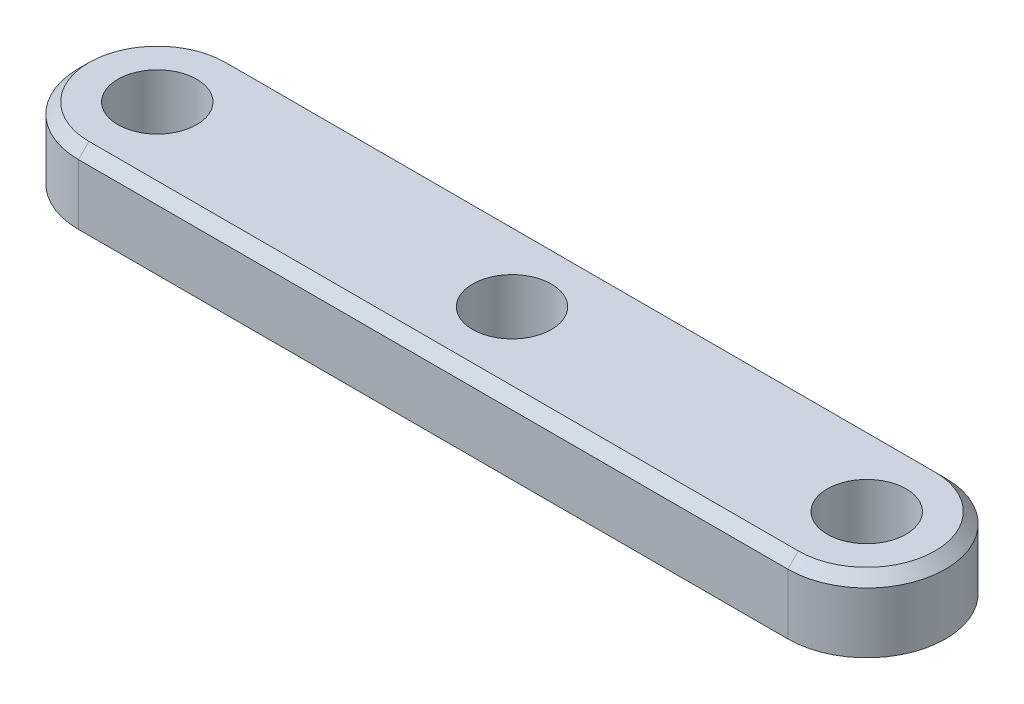
ISO-10303-21;
HEADER;
FILE_DESCRIPTION(('STEP AP214'),'2;1');
FILE_NAME('part.step','',(''),(''),'','','');
FILE_SCHEMA(('AUTOMOTIVE_DESIGN { 1 0 10303 214 1 1 1 1 }'));
ENDSEC;
DATA;
#1=APPLICATION_CONTEXT('core data for automotive mechanical design processes');
#2=APPLICATION_PROTOCOL_DEFINITION('international standard','automotive_design',2000,#1);
#3=PRODUCT_CONTEXT('',#1,'mechanical');
#4=PRODUCT('Part','Part','',(#3));
#5=PRODUCT_RELATED_PRODUCT_CATEGORY('part','',(#4));
#6=PRODUCT_DEFINITION_FORMATION('','',#4);
#7=PRODUCT_DEFINITION_CONTEXT('part definition',#1,'design');
#8=PRODUCT_DEFINITION('design','',#6,#7);
#9=PRODUCT_DEFINITION_SHAPE('','',#8);
#10=(LENGTH_UNIT() NAMED_UNIT(*) SI_UNIT(.MILLI.,.METRE.));
#11=(NAMED_UNIT(*) PLANE_ANGLE_UNIT() SI_UNIT($,.RADIAN.));
#12=(NAMED_UNIT(*) SI_UNIT($,.STERADIAN.) SOLID_ANGLE_UNIT());
#13=UNCERTAINTY_MEASURE_WITH_UNIT(LENGTH_MEASURE(1.E-05),#10,'distance_accuracy_value','');
#14=(GEOMETRIC_REPRESENTATION_CONTEXT(3) GLOBAL_UNCERTAINTY_ASSIGNED_CONTEXT((#13)) GLOBAL_UNIT_ASSIGNED_CONTEXT((#10,
#11,#12)) REPRESENTATION_CONTEXT('',''));
#15=CARTESIAN_POINT('',(0.,0.,0.));
#16=DIRECTION('',(0.,0.,1.));
#17=DIRECTION('',(1.,0.,0.));
#18=AXIS2_PLACEMENT_3D('',#15,#16,#17);
#19=CARTESIAN_POINT('',(-13.5,1.35,0.));
#20=DIRECTION('',(0.,1.,0.));
#21=DIRECTION('',(0.,0.,1.));
#22=AXIS2_PLACEMENT_3D('',#19,#20,#21);
#23=PLANE('',#22);
#24=DIRECTION('',(1.,0.,0.));
#25=VECTOR('',#24,1.);
#26=CARTESIAN_POINT('',(13.5,1.35,2.6));
#27=LINE('',#26,#25);
#28=CARTESIAN_POINT('',(-13.5,1.35,2.60000000000001));
#29=VERTEX_POINT('',#28);
#30=CARTESIAN_POINT('',(13.5,1.35,2.6));
#31=VERTEX_POINT('',#30);
#32=EDGE_CURVE('E105',#29,#31,#27,.T.);
#33=ORIENTED_EDGE('',*,*,#32,.T.);
#34=CARTESIAN_POINT('',(13.5,1.35,0.));
#35=DIRECTION('',(0.,1.,0.));
#36=DIRECTION('',(0.,0.,1.));
#37=AXIS2_PLACEMENT_3D('',#34,#35,#36);
#38=CIRCLE('',#37,2.60000000000001);
#39=CARTESIAN_POINT('',(13.5,1.35,-2.60000000000001));
#40=VERTEX_POINT('',#39);
#41=EDGE_CURVE('E150',#31,#40,#38,.T.);
#42=ORIENTED_EDGE('',*,*,#41,.T.);
#43=DIRECTION('',(-1.,0.,0.));
#44=VECTOR('',#43,1.);
#45=CARTESIAN_POINT('',(-13.5,1.35,-2.60000000000001));
#46=LINE('',#45,#44);
#47=CARTESIAN_POINT('',(-13.5,1.35,-2.6));
#48=VERTEX_POINT('',#47);
#49=EDGE_CURVE('E147',#40,#48,#46,.T.);
#50=ORIENTED_EDGE('',*,*,#49,.T.);
#51=CARTESIAN_POINT('',(-13.5,1.35,0.));
#52=DIRECTION('',(0.,1.,0.));
#53=DIRECTION('',(0.,0.,1.));
#54=AXIS2_PLACEMENT_3D('',#51,#52,#53);
#55=CIRCLE('',#54,2.60000000000001);
#56=EDGE_CURVE('E144',#48,#29,#55,.T.);
#57=ORIENTED_EDGE('',*,*,#56,.T.);
#58=EDGE_LOOP('',(#33,#42,#50,#57));
#59=FACE_BOUND('',#58,.T.);
#60=CARTESIAN_POINT('',(13.5,1.35,0.));
#61=DIRECTION('',(0.,1.,0.));
#62=DIRECTION('',(0.,0.,-1.));
#63=AXIS2_PLACEMENT_3D('',#60,#61,#62);
#64=CIRCLE('',#63,1.5);
#65=CARTESIAN_POINT('',(13.5,1.35,-1.5));
#66=VERTEX_POINT('',#65);
#67=EDGE_CURVE('E192',#66,#66,#64,.T.);
#68=ORIENTED_EDGE('',*,*,#67,.F.);
#69=EDGE_LOOP('',(#68));
#70=FACE_BOUND('',#69,.T.);
#71=CARTESIAN_POINT('',(-13.5,1.35,0.));
#72=DIRECTION('',(0.,1.,0.));
#73=DIRECTION('',(0.,0.,1.));
#74=AXIS2_PLACEMENT_3D('',#71,#72,#73);
#75=CIRCLE('',#74,1.5);
#76=CARTESIAN_POINT('',(-13.5,1.35,1.5));
#77=VERTEX_POINT('',#76);
#78=EDGE_CURVE('E122',#77,#77,#75,.T.);
#79=ORIENTED_EDGE('',*,*,#78,.F.);
#80=EDGE_LOOP('',(#79));
#81=FACE_BOUND('',#80,.T.);
#82=CARTESIAN_POINT('',(0.,1.35,0.));
#83=DIRECTION('',(0.,1.,0.));
#84=DIRECTION('',(0.,0.,1.));
#85=AXIS2_PLACEMENT_3D('',#82,#83,#84);
#86=CIRCLE('',#85,1.5);
#87=CARTESIAN_POINT('',(0.,1.35,1.5));
#88=VERTEX_POINT('',#87);
#89=EDGE_CURVE('E183',#88,#88,#86,.T.);
#90=ORIENTED_EDGE('',*,*,#89,.F.);
#91=EDGE_LOOP('',(#90));
#92=FACE_BOUND('',#91,.T.);
#93=ADVANCED_FACE('F45',(#59,#70,#81,#92),#23,.T.);
#94=CARTESIAN_POINT('',(-13.5,-1.35,0.));
#95=DIRECTION('',(0.,1.,0.));
#96=DIRECTION('',(0.,0.,1.));
#97=AXIS2_PLACEMENT_3D('',#94,#95,#96);
#98=PLANE('',#97);
#99=CARTESIAN_POINT('',(-13.5,-1.35,0.));
#100=DIRECTION('',(0.,1.,0.));
#101=DIRECTION('',(0.,0.,1.));
#102=AXIS2_PLACEMENT_3D('',#99,#100,#101);
#103=CIRCLE('',#102,3.);
#104=CARTESIAN_POINT('',(-13.5,-1.35,-3.));
#105=VERTEX_POINT('',#104);
#106=CARTESIAN_POINT('',(-13.5,-1.35,3.));
#107=VERTEX_POINT('',#106);
#108=EDGE_CURVE('E113',#105,#107,#103,.T.);
#109=ORIENTED_EDGE('',*,*,#108,.F.);
#110=DIRECTION('',(-1.,0.,0.));
#111=VECTOR('',#110,1.);
#112=CARTESIAN_POINT('',(-13.5,-1.35,-3.));
#113=LINE('',#112,#111);
#114=CARTESIAN_POINT('',(13.5,-1.35,-3.00000000000001));
#115=VERTEX_POINT('',#114);
#116=EDGE_CURVE('E132',#115,#105,#113,.T.);
#117=ORIENTED_EDGE('',*,*,#116,.F.);
#118=CARTESIAN_POINT('',(13.5,-1.35,0.));
#119=DIRECTION('',(0.,1.,0.));
#120=DIRECTION('',(0.,0.,1.));
#121=AXIS2_PLACEMENT_3D('',#118,#119,#120);
#122=CIRCLE('',#121,3.);
#123=CARTESIAN_POINT('',(13.5,-1.35,3.));
#124=VERTEX_POINT('',#123);
#125=EDGE_CURVE('E115',#124,#115,#122,.T.);
#126=ORIENTED_EDGE('',*,*,#125,.F.);
#127=DIRECTION('',(1.,0.,0.));
#128=VECTOR('',#127,1.);
#129=CARTESIAN_POINT('',(-13.5,-1.35,3.));
#130=LINE('',#129,#128);
#131=EDGE_CURVE('E101',#107,#124,#130,.T.);
#132=ORIENTED_EDGE('',*,*,#131,.F.);
#133=EDGE_LOOP('',(#109,#117,#126,#132));
#134=FACE_BOUND('',#133,.T.);
#135=CARTESIAN_POINT('',(-13.5,-1.35,0.));
#136=DIRECTION('',(0.,1.,0.));
#137=DIRECTION('',(0.,0.,1.));
#138=AXIS2_PLACEMENT_3D('',#135,#136,#137);
#139=CIRCLE('',#138,1.5);
#140=CARTESIAN_POINT('',(-13.5,-1.35,1.5));
#141=VERTEX_POINT('',#140);
#142=EDGE_CURVE('E126',#141,#141,#139,.T.);
#143=ORIENTED_EDGE('',*,*,#142,.T.);
#144=EDGE_LOOP('',(#143));
#145=FACE_BOUND('',#144,.T.);
#146=CARTESIAN_POINT('',(13.5,-1.35,0.));
#147=DIRECTION('',(0.,1.,0.));
#148=DIRECTION('',(0.,0.,-1.));
#149=AXIS2_PLACEMENT_3D('',#146,#147,#148);
#150=CIRCLE('',#149,1.5);
#151=CARTESIAN_POINT('',(13.5,-1.35,-1.5));
#152=VERTEX_POINT('',#151);
#153=EDGE_CURVE('E189',#152,#152,#150,.T.);
#154=ORIENTED_EDGE('',*,*,#153,.T.);
#155=EDGE_LOOP('',(#154));
#156=FACE_BOUND('',#155,.T.);
#157=CARTESIAN_POINT('',(0.,-1.35,0.));
#158=DIRECTION('',(0.,1.,0.));
#159=DIRECTION('',(0.,0.,1.));
#160=AXIS2_PLACEMENT_3D('',#157,#158,#159);
#161=CIRCLE('',#160,1.5);
#162=CARTESIAN_POINT('',(0.,-1.35,1.5));
#163=VERTEX_POINT('',#162);
#164=EDGE_CURVE('E177',#163,#163,#161,.T.);
#165=ORIENTED_EDGE('',*,*,#164,.T.);
#166=EDGE_LOOP('',(#165));
#167=FACE_BOUND('',#166,.T.);
#168=ADVANCED_FACE('F110',(#134,#145,#156,#167),#98,.F.);
#169=CARTESIAN_POINT('',(-13.5,1.35,0.));
#170=DIRECTION('',(0.,-1.,0.));
#171=DIRECTION('',(0.,0.,-1.));
#172=AXIS2_PLACEMENT_3D('',#169,#170,#171);
#173=CYLINDRICAL_SURFACE('',#172,3.);
#174=DIRECTION('',(0.,-1.,0.));
#175=VECTOR('',#174,1.);
#176=CARTESIAN_POINT('',(-13.5,1.35,3.));
#177=LINE('',#176,#175);
#178=CARTESIAN_POINT('',(-13.5,0.949999999999999,3.));
#179=VERTEX_POINT('',#178);
#180=EDGE_CURVE('E98',#179,#107,#177,.T.);
#181=ORIENTED_EDGE('',*,*,#180,.F.);
#182=CARTESIAN_POINT('',(-13.5,0.949999999999999,0.));
#183=DIRECTION('',(0.,1.,0.));
#184=DIRECTION('',(0.,0.,1.));
#185=AXIS2_PLACEMENT_3D('',#182,#183,#184);
#186=CIRCLE('',#185,3.);
#187=CARTESIAN_POINT('',(-13.5,0.949999999999999,-3.));
#188=VERTEX_POINT('',#187);
#189=EDGE_CURVE('E56',#179,#188,#186,.F.);
#190=ORIENTED_EDGE('',*,*,#189,.T.);
#191=DIRECTION('',(0.,-1.,0.));
#192=VECTOR('',#191,1.);
#193=CARTESIAN_POINT('',(-13.5,1.35,-3.));
#194=LINE('',#193,#192);
#195=EDGE_CURVE('E119',#188,#105,#194,.T.);
#196=ORIENTED_EDGE('',*,*,#195,.T.);
#197=ORIENTED_EDGE('',*,*,#108,.T.);
#198=EDGE_LOOP('',(#181,#190,#196,#197));
#199=FACE_BOUND('',#198,.T.);
#200=ADVANCED_FACE('F118',(#199),#173,.T.);
#201=CARTESIAN_POINT('',(-13.5,1.35,3.));
#202=DIRECTION('',(0.,0.,-1.));
#203=DIRECTION('',(-1.,0.,0.));
#204=AXIS2_PLACEMENT_3D('',#201,#202,#203);
#205=PLANE('',#204);
#206=DIRECTION('',(0.,-1.,0.));
#207=VECTOR('',#206,1.);
#208=CARTESIAN_POINT('',(13.5,1.35,3.));
#209=LINE('',#208,#207);
#210=CARTESIAN_POINT('',(13.5,0.949999999999999,3.));
#211=VERTEX_POINT('',#210);
#212=EDGE_CURVE('E106',#211,#124,#209,.T.);
#213=ORIENTED_EDGE('',*,*,#212,.F.);
#214=DIRECTION('',(-1.,0.,0.));
#215=VECTOR('',#214,1.);
#216=CARTESIAN_POINT('',(-13.5,0.949999999999999,3.));
#217=LINE('',#216,#215);
#218=EDGE_CURVE('E11',#211,#179,#217,.T.);
#219=ORIENTED_EDGE('',*,*,#218,.T.);
#220=ORIENTED_EDGE('',*,*,#180,.T.);
#221=ORIENTED_EDGE('',*,*,#131,.T.);
#222=EDGE_LOOP('',(#213,#219,#220,#221));
#223=FACE_BOUND('',#222,.T.);
#224=ADVANCED_FACE('F100',(#223),#205,.F.);
#225=CARTESIAN_POINT('',(13.5,1.35,0.));
#226=DIRECTION('',(0.,-1.,0.));
#227=DIRECTION('',(0.,0.,-1.));
#228=AXIS2_PLACEMENT_3D('',#225,#226,#227);
#229=CYLINDRICAL_SURFACE('',#228,3.);
#230=DIRECTION('',(0.,-1.,0.));
#231=VECTOR('',#230,1.);
#232=CARTESIAN_POINT('',(13.5,1.35,-3.00000000000001));
#233=LINE('',#232,#231);
#234=CARTESIAN_POINT('',(13.5,0.949999999999999,-3.00000000000001));
#235=VERTEX_POINT('',#234);
#236=EDGE_CURVE('E137',#235,#115,#233,.T.);
#237=ORIENTED_EDGE('',*,*,#236,.F.);
#238=CARTESIAN_POINT('',(13.5,0.949999999999999,0.));
#239=DIRECTION('',(0.,1.,0.));
#240=DIRECTION('',(0.,0.,1.));
#241=AXIS2_PLACEMENT_3D('',#238,#239,#240);
#242=CIRCLE('',#241,3.);
#243=EDGE_CURVE('E154',#235,#211,#242,.F.);
#244=ORIENTED_EDGE('',*,*,#243,.T.);
#245=ORIENTED_EDGE('',*,*,#212,.T.);
#246=ORIENTED_EDGE('',*,*,#125,.T.);
#247=EDGE_LOOP('',(#237,#244,#245,#246));
#248=FACE_BOUND('',#247,.T.);
#249=ADVANCED_FACE('F227',(#248),#229,.T.);
#250=CARTESIAN_POINT('',(-13.5,1.35,-3.));
#251=DIRECTION('',(0.,0.,1.));
#252=DIRECTION('',(1.,0.,0.));
#253=AXIS2_PLACEMENT_3D('',#250,#251,#252);
#254=PLANE('',#253);
#255=ORIENTED_EDGE('',*,*,#195,.F.);
#256=DIRECTION('',(1.,0.,0.));
#257=VECTOR('',#256,1.);
#258=CARTESIAN_POINT('',(13.5,0.949999999999999,-3.00000000000001));
#259=LINE('',#258,#257);
#260=EDGE_CURVE('E158',#188,#235,#259,.T.);
#261=ORIENTED_EDGE('',*,*,#260,.T.);
#262=ORIENTED_EDGE('',*,*,#236,.T.);
#263=ORIENTED_EDGE('',*,*,#116,.T.);
#264=EDGE_LOOP('',(#255,#261,#262,#263));
#265=FACE_BOUND('',#264,.T.);
#266=ADVANCED_FACE('F213',(#265),#254,.F.);
#267=CARTESIAN_POINT('',(-13.5,1.35,0.));
#268=DIRECTION('',(0.,-1.,0.));
#269=DIRECTION('',(0.,0.,-1.));
#270=AXIS2_PLACEMENT_3D('',#267,#268,#269);
#271=CYLINDRICAL_SURFACE('',#270,1.5);
#272=ORIENTED_EDGE('',*,*,#78,.T.);
#273=EDGE_LOOP('',(#272));
#274=FACE_BOUND('',#273,.T.);
#275=ORIENTED_EDGE('',*,*,#142,.F.);
#276=EDGE_LOOP('',(#275));
#277=FACE_BOUND('',#276,.T.);
#278=ADVANCED_FACE('F204',(#274,#277),#271,.F.);
#279=CARTESIAN_POINT('',(13.5,1.35,0.));
#280=DIRECTION('',(0.,-1.,0.));
#281=DIRECTION('',(0.,0.,-1.));
#282=AXIS2_PLACEMENT_3D('',#279,#280,#281);
#283=CYLINDRICAL_SURFACE('',#282,1.5);
#284=ORIENTED_EDGE('',*,*,#67,.T.);
#285=EDGE_LOOP('',(#284));
#286=FACE_BOUND('',#285,.T.);
#287=ORIENTED_EDGE('',*,*,#153,.F.);
#288=EDGE_LOOP('',(#287));
#289=FACE_BOUND('',#288,.T.);
#290=ADVANCED_FACE('F201',(#286,#289),#283,.F.);
#291=CARTESIAN_POINT('',(0.,1.35,0.));
#292=DIRECTION('',(0.,-1.,0.));
#293=DIRECTION('',(0.,0.,-1.));
#294=AXIS2_PLACEMENT_3D('',#291,#292,#293);
#295=CYLINDRICAL_SURFACE('',#294,1.5);
#296=ORIENTED_EDGE('',*,*,#89,.T.);
#297=EDGE_LOOP('',(#296));
#298=FACE_BOUND('',#297,.T.);
#299=ORIENTED_EDGE('',*,*,#164,.F.);
#300=EDGE_LOOP('',(#299));
#301=FACE_BOUND('',#300,.T.);
#302=ADVANCED_FACE('F203',(#298,#301),#295,.F.);
#303=CARTESIAN_POINT('',(-13.5,1.35,0.));
#304=DIRECTION('',(0.,-1.,0.));
#305=DIRECTION('',(0.,0.,-1.));
#306=AXIS2_PLACEMENT_3D('',#303,#304,#305);
#307=CONICAL_SURFACE('',#306,2.60000000000001,0.785398163397444);
#308=DIRECTION('',(0.,0.707106781186551,0.707106781186544));
#309=VECTOR('',#308,1.);
#310=CARTESIAN_POINT('',(-13.5,0.949999999999999,-3.));
#311=LINE('',#310,#309);
#312=EDGE_CURVE('E168',#188,#48,#311,.T.);
#313=ORIENTED_EDGE('',*,*,#312,.F.);
#314=ORIENTED_EDGE('',*,*,#189,.F.);
#315=DIRECTION('',(0.,-0.707106781186551,0.707106781186544));
#316=VECTOR('',#315,1.);
#317=CARTESIAN_POINT('',(-13.5,1.35,2.60000000000001));
#318=LINE('',#317,#316);
#319=EDGE_CURVE('E50',#29,#179,#318,.T.);
#320=ORIENTED_EDGE('',*,*,#319,.F.);
#321=ORIENTED_EDGE('',*,*,#56,.F.);
#322=EDGE_LOOP('',(#313,#314,#320,#321));
#323=FACE_BOUND('',#322,.T.);
#324=ADVANCED_FACE('F48',(#323),#307,.T.);
#325=CARTESIAN_POINT('',(-13.5,1.35,2.60000000000001));
#326=DIRECTION('',(0.,0.707106781186544,0.707106781186551));
#327=DIRECTION('',(-1.,0.,0.));
#328=AXIS2_PLACEMENT_3D('',#325,#326,#327);
#329=PLANE('',#328);
#330=ORIENTED_EDGE('',*,*,#319,.T.);
#331=ORIENTED_EDGE('',*,*,#218,.F.);
#332=DIRECTION('',(0.,-0.707106781186551,0.707106781186544));
#333=VECTOR('',#332,1.);
#334=CARTESIAN_POINT('',(13.5,1.35,2.6));
#335=LINE('',#334,#333);
#336=EDGE_CURVE('E166',#31,#211,#335,.T.);
#337=ORIENTED_EDGE('',*,*,#336,.F.);
#338=ORIENTED_EDGE('',*,*,#32,.F.);
#339=EDGE_LOOP('',(#330,#331,#337,#338));
#340=FACE_BOUND('',#339,.T.);
#341=ADVANCED_FACE('F249',(#340),#329,.T.);
#342=CARTESIAN_POINT('',(-13.5,1.35,-2.60000000000001));
#343=DIRECTION('',(0.,0.707106781186544,-0.707106781186551));
#344=DIRECTION('',(1.,0.,0.));
#345=AXIS2_PLACEMENT_3D('',#342,#343,#344);
#346=PLANE('',#345);
#347=ORIENTED_EDGE('',*,*,#312,.T.);
#348=ORIENTED_EDGE('',*,*,#49,.F.);
#349=DIRECTION('',(0.,0.707106781186551,0.707106781186544));
#350=VECTOR('',#349,1.);
#351=CARTESIAN_POINT('',(13.5,0.949999999999999,-3.00000000000001));
#352=LINE('',#351,#350);
#353=EDGE_CURVE('E163',#235,#40,#352,.T.);
#354=ORIENTED_EDGE('',*,*,#353,.F.);
#355=ORIENTED_EDGE('',*,*,#260,.F.);
#356=EDGE_LOOP('',(#347,#348,#354,#355));
#357=FACE_BOUND('',#356,.T.);
#358=ADVANCED_FACE('F243',(#357),#346,.T.);
#359=CARTESIAN_POINT('',(13.5,1.35,0.));
#360=DIRECTION('',(0.,-1.,0.));
#361=DIRECTION('',(0.,0.,-1.));
#362=AXIS2_PLACEMENT_3D('',#359,#360,#361);
#363=CONICAL_SURFACE('',#362,2.60000000000001,0.785398163397444);
#364=ORIENTED_EDGE('',*,*,#336,.T.);
#365=ORIENTED_EDGE('',*,*,#243,.F.);
#366=ORIENTED_EDGE('',*,*,#353,.T.);
#367=ORIENTED_EDGE('',*,*,#41,.F.);
#368=EDGE_LOOP('',(#364,#365,#366,#367));
#369=FACE_BOUND('',#368,.T.);
#370=ADVANCED_FACE('F237',(#369),#363,.T.);
#371=CLOSED_SHELL('',(#93,#168,#200,#224,#249,#266,#278,#290,#302,#324,#341,#358,#370));
#372=MANIFOLD_SOLID_BREP('B2',#371);
#373=ADVANCED_BREP_SHAPE_REPRESENTATION('',(#18,#372),#14);
#374=SHAPE_DEFINITION_REPRESENTATION(#9,#373);
ENDSEC;
END-ISO-10303-21;
